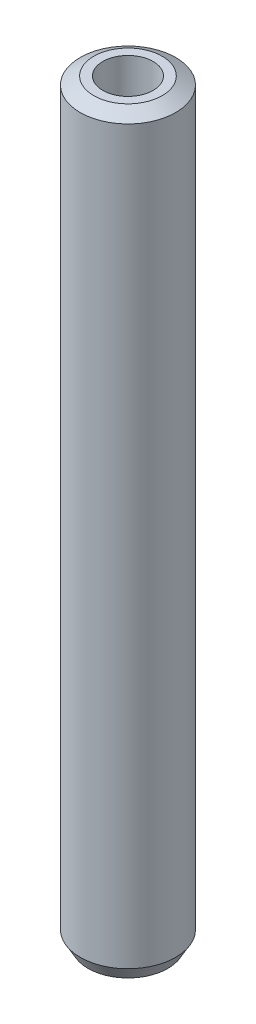
ISO-10303-21;
HEADER;
FILE_DESCRIPTION(('STEP AP214'),'2;1');
FILE_NAME('part.step','',(''),(''),'','','');
FILE_SCHEMA(('AUTOMOTIVE_DESIGN { 1 0 10303 214 1 1 1 1 }'));
ENDSEC;
DATA;
#1=APPLICATION_CONTEXT('core data for automotive mechanical design processes');
#2=APPLICATION_PROTOCOL_DEFINITION('international standard','automotive_design',2000,#1);
#3=PRODUCT_CONTEXT('',#1,'mechanical');
#4=PRODUCT('Part','Part','',(#3));
#5=PRODUCT_RELATED_PRODUCT_CATEGORY('part','',(#4));
#6=PRODUCT_DEFINITION_FORMATION('','',#4);
#7=PRODUCT_DEFINITION_CONTEXT('part definition',#1,'design');
#8=PRODUCT_DEFINITION('design','',#6,#7);
#9=PRODUCT_DEFINITION_SHAPE('','',#8);
#10=(LENGTH_UNIT() NAMED_UNIT(*) SI_UNIT(.MILLI.,.METRE.));
#11=(NAMED_UNIT(*) PLANE_ANGLE_UNIT() SI_UNIT($,.RADIAN.));
#12=(NAMED_UNIT(*) SI_UNIT($,.STERADIAN.) SOLID_ANGLE_UNIT());
#13=UNCERTAINTY_MEASURE_WITH_UNIT(LENGTH_MEASURE(1.E-05),#10,'distance_accuracy_value','');
#14=(GEOMETRIC_REPRESENTATION_CONTEXT(3) GLOBAL_UNCERTAINTY_ASSIGNED_CONTEXT((#13)) GLOBAL_UNIT_ASSIGNED_CONTEXT((#10,
#11,#12)) REPRESENTATION_CONTEXT('',''));
#15=CARTESIAN_POINT('',(0.,0.,0.));
#16=DIRECTION('',(0.,0.,1.));
#17=DIRECTION('',(1.,0.,0.));
#18=AXIS2_PLACEMENT_3D('',#15,#16,#17);
#19=CARTESIAN_POINT('',(0.,394.20869801296,0.));
#20=DIRECTION('',(0.,-1.,0.));
#21=DIRECTION('',(0.,0.,-1.));
#22=AXIS2_PLACEMENT_3D('',#19,#20,#21);
#23=CYLINDRICAL_SURFACE('',#22,25.);
#24=CARTESIAN_POINT('',(0.,390.110625450542,0.));
#25=DIRECTION('',(0.,1.,0.));
#26=DIRECTION('',(0.,0.,1.));
#27=AXIS2_PLACEMENT_3D('',#24,#25,#26);
#28=CIRCLE('',#27,25.);
#29=CARTESIAN_POINT('',(0.,390.110625450542,25.));
#30=VERTEX_POINT('',#29);
#31=EDGE_CURVE('E50',#30,#30,#28,.F.);
#32=ORIENTED_EDGE('',*,*,#31,.T.);
#33=EDGE_LOOP('',(#32));
#34=FACE_BOUND('',#33,.T.);
#35=CARTESIAN_POINT('',(0.,7.09806989121164,0.));
#36=DIRECTION('',(0.,1.,0.));
#37=DIRECTION('',(0.,0.,1.));
#38=AXIS2_PLACEMENT_3D('',#35,#36,#37);
#39=CIRCLE('',#38,25.);
#40=CARTESIAN_POINT('',(0.,7.09806989121164,25.));
#41=VERTEX_POINT('',#40);
#42=EDGE_CURVE('E51',#41,#41,#39,.T.);
#43=ORIENTED_EDGE('',*,*,#42,.T.);
#44=EDGE_LOOP('',(#43));
#45=FACE_BOUND('',#44,.T.);
#46=ADVANCED_FACE('F39',(#34,#45),#23,.T.);
#47=CARTESIAN_POINT('',(0.,394.20869801296,0.));
#48=DIRECTION('',(0.,1.,0.));
#49=DIRECTION('',(0.,0.,1.));
#50=AXIS2_PLACEMENT_3D('',#47,#48,#49);
#51=PLANE('',#50);
#52=CARTESIAN_POINT('',(0.,394.20869801296,0.));
#53=DIRECTION('',(0.,1.,0.));
#54=DIRECTION('',(0.,0.,1.));
#55=AXIS2_PLACEMENT_3D('',#52,#53,#54);
#56=CIRCLE('',#55,17.9019301087883);
#57=CARTESIAN_POINT('',(0.,394.20869801296,17.9019301087883));
#58=VERTEX_POINT('',#57);
#59=EDGE_CURVE('E54',#58,#58,#56,.T.);
#60=ORIENTED_EDGE('',*,*,#59,.T.);
#61=EDGE_LOOP('',(#60));
#62=FACE_BOUND('',#61,.T.);
#63=CARTESIAN_POINT('',(0.,394.20869801296,0.));
#64=DIRECTION('',(0.,1.,0.));
#65=DIRECTION('',(0.,0.,1.));
#66=AXIS2_PLACEMENT_3D('',#63,#64,#65);
#67=CIRCLE('',#66,13.1578040041224);
#68=CARTESIAN_POINT('',(0.,394.20869801296,13.1578040041224));
#69=VERTEX_POINT('',#68);
#70=EDGE_CURVE('E58',#69,#69,#67,.T.);
#71=ORIENTED_EDGE('',*,*,#70,.F.);
#72=EDGE_LOOP('',(#71));
#73=FACE_BOUND('',#72,.T.);
#74=ADVANCED_FACE('F69',(#62,#73),#51,.T.);
#75=CARTESIAN_POINT('',(0.,0.,0.));
#76=DIRECTION('',(0.,1.,0.));
#77=DIRECTION('',(0.,0.,1.));
#78=AXIS2_PLACEMENT_3D('',#75,#76,#77);
#79=PLANE('',#78);
#80=CARTESIAN_POINT('',(0.,0.,0.));
#81=DIRECTION('',(0.,1.,0.));
#82=DIRECTION('',(0.,0.,1.));
#83=AXIS2_PLACEMENT_3D('',#80,#81,#82);
#84=CIRCLE('',#83,20.9019274375822);
#85=CARTESIAN_POINT('',(0.,0.,20.9019274375822));
#86=VERTEX_POINT('',#85);
#87=EDGE_CURVE('E10',#86,#86,#84,.F.);
#88=ORIENTED_EDGE('',*,*,#87,.T.);
#89=EDGE_LOOP('',(#88));
#90=FACE_BOUND('',#89,.T.);
#91=CARTESIAN_POINT('',(0.,0.,0.));
#92=DIRECTION('',(0.,1.,0.));
#93=DIRECTION('',(0.,0.,1.));
#94=AXIS2_PLACEMENT_3D('',#91,#92,#93);
#95=CIRCLE('',#94,13.1578040041224);
#96=CARTESIAN_POINT('',(0.,0.,13.1578040041224));
#97=VERTEX_POINT('',#96);
#98=EDGE_CURVE('E63',#97,#97,#95,.T.);
#99=ORIENTED_EDGE('',*,*,#98,.T.);
#100=EDGE_LOOP('',(#99));
#101=FACE_BOUND('',#100,.T.);
#102=ADVANCED_FACE('F75',(#90,#101),#79,.F.);
#103=CARTESIAN_POINT('',(0.,394.20869801296,0.));
#104=DIRECTION('',(0.,-1.,0.));
#105=DIRECTION('',(0.,0.,-1.));
#106=AXIS2_PLACEMENT_3D('',#103,#104,#105);
#107=CYLINDRICAL_SURFACE('',#106,13.1578040041224);
#108=ORIENTED_EDGE('',*,*,#70,.T.);
#109=EDGE_LOOP('',(#108));
#110=FACE_BOUND('',#109,.T.);
#111=ORIENTED_EDGE('',*,*,#98,.F.);
#112=EDGE_LOOP('',(#111));
#113=FACE_BOUND('',#112,.T.);
#114=ADVANCED_FACE('F70',(#110,#113),#107,.F.);
#115=CARTESIAN_POINT('',(0.,394.20869801296,0.));
#116=DIRECTION('',(0.,-1.,0.));
#117=DIRECTION('',(0.,0.,-1.));
#118=AXIS2_PLACEMENT_3D('',#115,#116,#117);
#119=CONICAL_SURFACE('',#118,17.9019301087883,1.04719755119659);
#120=ORIENTED_EDGE('',*,*,#31,.F.);
#121=EDGE_LOOP('',(#120));
#122=FACE_BOUND('',#121,.T.);
#123=ORIENTED_EDGE('',*,*,#59,.F.);
#124=EDGE_LOOP('',(#123));
#125=FACE_BOUND('',#124,.T.);
#126=ADVANCED_FACE('F81',(#122,#125),#119,.T.);
#127=CARTESIAN_POINT('',(0.,7.09806989121164,0.));
#128=DIRECTION('',(0.,1.,0.));
#129=DIRECTION('',(0.,0.,1.));
#130=AXIS2_PLACEMENT_3D('',#127,#128,#129);
#131=CONICAL_SURFACE('',#130,25.,0.523598775598302);
#132=ORIENTED_EDGE('',*,*,#87,.F.);
#133=EDGE_LOOP('',(#132));
#134=FACE_BOUND('',#133,.T.);
#135=ORIENTED_EDGE('',*,*,#42,.F.);
#136=EDGE_LOOP('',(#135));
#137=FACE_BOUND('',#136,.T.);
#138=ADVANCED_FACE('F45',(#134,#137),#131,.T.);
#139=CLOSED_SHELL('',(#46,#74,#102,#114,#126,#138));
#140=MANIFOLD_SOLID_BREP('B2',#139);
#141=ADVANCED_BREP_SHAPE_REPRESENTATION('',(#18,#140),#14);
#142=SHAPE_DEFINITION_REPRESENTATION(#9,#141);
ENDSEC;
END-ISO-10303-21;
